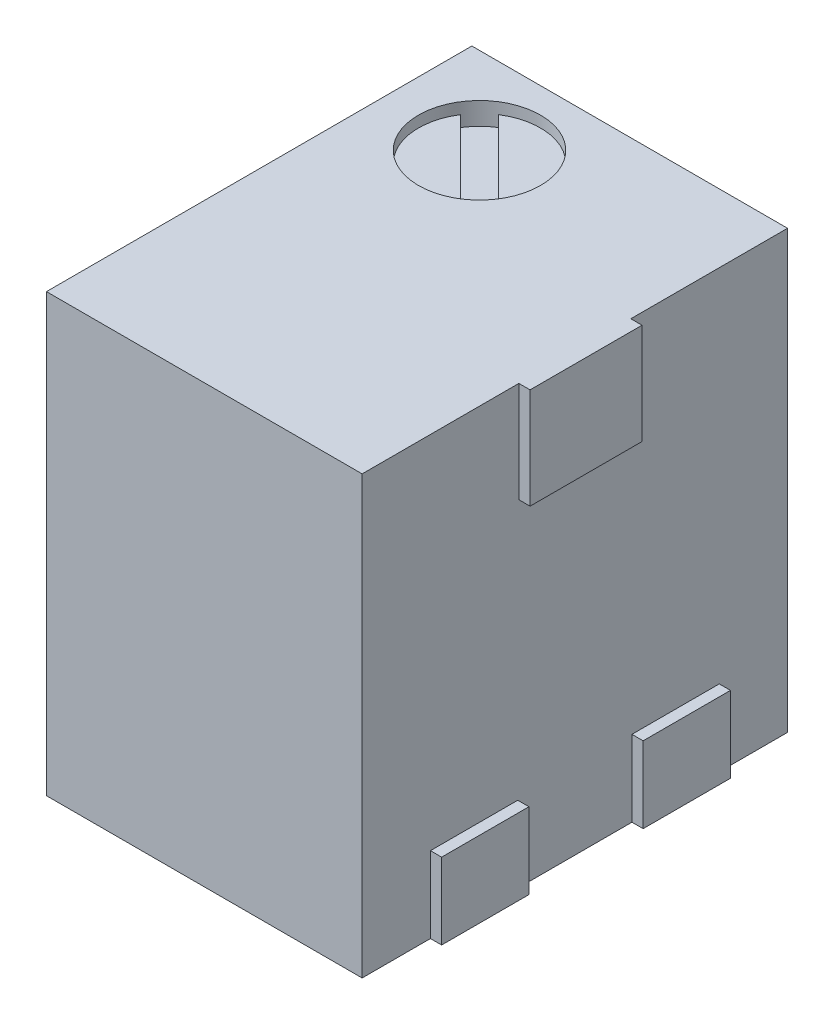
ISO-10303-21;
HEADER;
FILE_DESCRIPTION(('STEP AP214'),'2;1');
FILE_NAME('part.step','',(''),(''),'','','');
FILE_SCHEMA(('AUTOMOTIVE_DESIGN { 1 0 10303 214 1 1 1 1 }'));
ENDSEC;
DATA;
#1=APPLICATION_CONTEXT('core data for automotive mechanical design processes');
#2=APPLICATION_PROTOCOL_DEFINITION('international standard','automotive_design',2000,#1);
#3=PRODUCT_CONTEXT('',#1,'mechanical');
#4=PRODUCT('Part','Part','',(#3));
#5=PRODUCT_RELATED_PRODUCT_CATEGORY('part','',(#4));
#6=PRODUCT_DEFINITION_FORMATION('','',#4);
#7=PRODUCT_DEFINITION_CONTEXT('part definition',#1,'design');
#8=PRODUCT_DEFINITION('design','',#6,#7);
#9=PRODUCT_DEFINITION_SHAPE('','',#8);
#10=(LENGTH_UNIT() NAMED_UNIT(*) SI_UNIT(.MILLI.,.METRE.));
#11=(NAMED_UNIT(*) PLANE_ANGLE_UNIT() SI_UNIT($,.RADIAN.));
#12=(NAMED_UNIT(*) SI_UNIT($,.STERADIAN.) SOLID_ANGLE_UNIT());
#13=UNCERTAINTY_MEASURE_WITH_UNIT(LENGTH_MEASURE(1.E-05),#10,'distance_accuracy_value','');
#14=(GEOMETRIC_REPRESENTATION_CONTEXT(3) GLOBAL_UNCERTAINTY_ASSIGNED_CONTEXT((#13)) GLOBAL_UNIT_ASSIGNED_CONTEXT((#10,
#11,#12)) REPRESENTATION_CONTEXT('',''));
#15=CARTESIAN_POINT('',(0.,0.,0.));
#16=DIRECTION('',(0.,0.,1.));
#17=DIRECTION('',(1.,0.,0.));
#18=AXIS2_PLACEMENT_3D('',#15,#16,#17);
#19=CARTESIAN_POINT('',(-24.148398,1.41349999999973,111.847008));
#20=DIRECTION('',(-1.,0.,0.));
#21=DIRECTION('',(0.,0.,1.));
#22=AXIS2_PLACEMENT_3D('',#19,#20,#21);
#23=PLANE('',#22);
#24=DIRECTION('',(0.,0.,1.));
#25=VECTOR('',#24,1.);
#26=CARTESIAN_POINT('',(-24.148398,-1.06300000000027,111.847008));
#27=LINE('',#26,#25);
#28=CARTESIAN_POINT('',(-24.148398,-1.06300000000027,109.434008));
#29=VERTEX_POINT('',#28);
#30=CARTESIAN_POINT('',(-24.148398,-1.06300000000027,114.260008));
#31=VERTEX_POINT('',#30);
#32=EDGE_CURVE('E11',#29,#31,#27,.T.);
#33=ORIENTED_EDGE('',*,*,#32,.T.);
#34=DIRECTION('',(0.,1.,0.));
#35=VECTOR('',#34,1.);
#36=CARTESIAN_POINT('',(-24.148398,1.41349999999973,114.260008));
#37=LINE('',#36,#35);
#38=CARTESIAN_POINT('',(-24.148398,3.88999999999973,114.260008));
#39=VERTEX_POINT('',#38);
#40=EDGE_CURVE('E27',#31,#39,#37,.T.);
#41=ORIENTED_EDGE('',*,*,#40,.T.);
#42=DIRECTION('',(0.,0.,-1.));
#43=VECTOR('',#42,1.);
#44=CARTESIAN_POINT('',(-24.148398,3.88999999999973,111.847008));
#45=LINE('',#44,#43);
#46=CARTESIAN_POINT('',(-24.148398,3.88999999999973,109.434008));
#47=VERTEX_POINT('',#46);
#48=EDGE_CURVE('E195',#39,#47,#45,.T.);
#49=ORIENTED_EDGE('',*,*,#48,.T.);
#50=DIRECTION('',(0.,-1.,0.));
#51=VECTOR('',#50,1.);
#52=CARTESIAN_POINT('',(-24.148398,1.41349999999973,109.434008));
#53=LINE('',#52,#51);
#54=EDGE_CURVE('E220',#47,#29,#53,.T.);
#55=ORIENTED_EDGE('',*,*,#54,.T.);
#56=EDGE_LOOP('',(#33,#41,#49,#55));
#57=FACE_BOUND('',#56,.T.);
#58=ADVANCED_FACE('F17',(#57),#23,.T.);
#59=CARTESIAN_POINT('',(-20.4399979999999,3.88999999999973,114.260008));
#60=DIRECTION('',(0.,0.,1.));
#61=DIRECTION('',(0.,-1.,0.));
#62=AXIS2_PLACEMENT_3D('',#59,#60,#61);
#63=PLANE('',#62);
#64=DIRECTION('',(0.,1.,0.));
#65=VECTOR('',#64,1.);
#66=CARTESIAN_POINT('',(-20.5669979999999,3.88999999999973,114.260008));
#67=LINE('',#66,#65);
#68=CARTESIAN_POINT('',(-20.5669979999999,-1.06300000000027,114.260008));
#69=VERTEX_POINT('',#68);
#70=CARTESIAN_POINT('',(-20.5669979999999,3.88999999999973,114.260008));
#71=VERTEX_POINT('',#70);
#72=EDGE_CURVE('E217',#69,#71,#67,.T.);
#73=ORIENTED_EDGE('',*,*,#72,.T.);
#74=DIRECTION('',(-1.,0.,0.));
#75=VECTOR('',#74,1.);
#76=CARTESIAN_POINT('',(-20.4399979999999,3.88999999999973,114.260008));
#77=LINE('',#76,#75);
#78=EDGE_CURVE('E215',#71,#39,#77,.T.);
#79=ORIENTED_EDGE('',*,*,#78,.T.);
#80=ORIENTED_EDGE('',*,*,#40,.F.);
#81=DIRECTION('',(1.,0.,0.));
#82=VECTOR('',#81,1.);
#83=CARTESIAN_POINT('',(-20.4399979999999,-1.06300000000027,114.260008));
#84=LINE('',#83,#82);
#85=EDGE_CURVE('E36',#31,#69,#84,.T.);
#86=ORIENTED_EDGE('',*,*,#85,.T.);
#87=EDGE_LOOP('',(#73,#79,#80,#86));
#88=FACE_BOUND('',#87,.T.);
#89=ADVANCED_FACE('F341',(#88),#63,.T.);
#90=CARTESIAN_POINT('',(-20.4399979999999,-1.06300000000027,114.260008));
#91=DIRECTION('',(0.,-1.,0.));
#92=DIRECTION('',(0.,0.,-1.));
#93=AXIS2_PLACEMENT_3D('',#90,#91,#92);
#94=PLANE('',#93);
#95=DIRECTION('',(0.,0.,1.));
#96=VECTOR('',#95,1.);
#97=CARTESIAN_POINT('',(-20.5669979999999,-1.06300000000027,114.260008));
#98=LINE('',#97,#96);
#99=CARTESIAN_POINT('',(-20.5669979999999,-1.06300000000027,113.485308));
#100=VERTEX_POINT('',#99);
#101=EDGE_CURVE('E221',#100,#69,#98,.T.);
#102=ORIENTED_EDGE('',*,*,#101,.T.);
#103=ORIENTED_EDGE('',*,*,#85,.F.);
#104=ORIENTED_EDGE('',*,*,#32,.F.);
#105=DIRECTION('',(1.,0.,0.));
#106=VECTOR('',#105,1.);
#107=CARTESIAN_POINT('',(-20.4399979999999,-1.06300000000027,109.434008));
#108=LINE('',#107,#106);
#109=CARTESIAN_POINT('',(-20.5669979999999,-1.06300000000027,109.434008));
#110=VERTEX_POINT('',#109);
#111=EDGE_CURVE('E183',#29,#110,#108,.T.);
#112=ORIENTED_EDGE('',*,*,#111,.T.);
#113=DIRECTION('',(0.,0.,1.));
#114=VECTOR('',#113,1.);
#115=CARTESIAN_POINT('',(-20.5669979999999,-1.06300000000027,114.260008));
#116=LINE('',#115,#114);
#117=CARTESIAN_POINT('',(-20.5669979999999,-1.06300000000027,110.208708));
#118=VERTEX_POINT('',#117);
#119=EDGE_CURVE('E167',#110,#118,#116,.T.);
#120=ORIENTED_EDGE('',*,*,#119,.T.);
#121=DIRECTION('',(1.,0.,0.));
#122=VECTOR('',#121,1.);
#123=CARTESIAN_POINT('',(-20.4399979999999,-1.06300000000027,110.208708));
#124=LINE('',#123,#122);
#125=CARTESIAN_POINT('',(-20.4399979999999,-1.06300000000027,110.208708));
#126=VERTEX_POINT('',#125);
#127=EDGE_CURVE('E164',#118,#126,#124,.T.);
#128=ORIENTED_EDGE('',*,*,#127,.T.);
#129=DIRECTION('',(0.,0.,1.));
#130=VECTOR('',#129,1.);
#131=CARTESIAN_POINT('',(-20.4399979999999,-1.06300000000027,114.260008));
#132=LINE('',#131,#130);
#133=CARTESIAN_POINT('',(-20.4399979999999,-1.06300000000027,111.199308));
#134=VERTEX_POINT('',#133);
#135=EDGE_CURVE('E168',#126,#134,#132,.T.);
#136=ORIENTED_EDGE('',*,*,#135,.T.);
#137=DIRECTION('',(-1.,0.,0.));
#138=VECTOR('',#137,1.);
#139=CARTESIAN_POINT('',(-20.4399979999999,-1.06300000000027,111.199308));
#140=LINE('',#139,#138);
#141=CARTESIAN_POINT('',(-20.5669979999999,-1.06300000000027,111.199308));
#142=VERTEX_POINT('',#141);
#143=EDGE_CURVE('E157',#134,#142,#140,.T.);
#144=ORIENTED_EDGE('',*,*,#143,.T.);
#145=DIRECTION('',(0.,0.,1.));
#146=VECTOR('',#145,1.);
#147=CARTESIAN_POINT('',(-20.5669979999999,-1.06300000000027,114.260008));
#148=LINE('',#147,#146);
#149=CARTESIAN_POINT('',(-20.5669979999999,-1.06300000000027,112.494708));
#150=VERTEX_POINT('',#149);
#151=EDGE_CURVE('E224',#142,#150,#148,.T.);
#152=ORIENTED_EDGE('',*,*,#151,.T.);
#153=DIRECTION('',(1.,0.,0.));
#154=VECTOR('',#153,1.);
#155=CARTESIAN_POINT('',(-20.4399979999999,-1.06300000000027,112.494708));
#156=LINE('',#155,#154);
#157=CARTESIAN_POINT('',(-20.4399979999999,-1.06300000000027,112.494708));
#158=VERTEX_POINT('',#157);
#159=EDGE_CURVE('E227',#150,#158,#156,.T.);
#160=ORIENTED_EDGE('',*,*,#159,.T.);
#161=DIRECTION('',(0.,0.,1.));
#162=VECTOR('',#161,1.);
#163=CARTESIAN_POINT('',(-20.4399979999999,-1.06300000000027,114.260008));
#164=LINE('',#163,#162);
#165=CARTESIAN_POINT('',(-20.4399979999999,-1.06300000000027,113.485308));
#166=VERTEX_POINT('',#165);
#167=EDGE_CURVE('E289',#158,#166,#164,.T.);
#168=ORIENTED_EDGE('',*,*,#167,.T.);
#169=DIRECTION('',(-1.,0.,0.));
#170=VECTOR('',#169,1.);
#171=CARTESIAN_POINT('',(-20.4399979999999,-1.06300000000027,113.485308));
#172=LINE('',#171,#170);
#173=EDGE_CURVE('E233',#166,#100,#172,.T.);
#174=ORIENTED_EDGE('',*,*,#173,.T.);
#175=EDGE_LOOP('',(#102,#103,#104,#112,#120,#128,#136,#144,#152,#160,#168,#174));
#176=FACE_BOUND('',#175,.T.);
#177=ADVANCED_FACE('F287',(#176),#94,.T.);
#178=CARTESIAN_POINT('',(-20.4399979999999,-1.06300000000027,109.434008));
#179=DIRECTION('',(0.,0.,-1.));
#180=DIRECTION('',(-1.,0.,0.));
#181=AXIS2_PLACEMENT_3D('',#178,#179,#180);
#182=PLANE('',#181);
#183=DIRECTION('',(0.,-1.,0.));
#184=VECTOR('',#183,1.);
#185=CARTESIAN_POINT('',(-20.5669979999999,-1.06300000000027,109.434008));
#186=LINE('',#185,#184);
#187=CARTESIAN_POINT('',(-20.5669979999999,3.88999999999973,109.434008));
#188=VERTEX_POINT('',#187);
#189=EDGE_CURVE('E230',#188,#110,#186,.T.);
#190=ORIENTED_EDGE('',*,*,#189,.T.);
#191=ORIENTED_EDGE('',*,*,#111,.F.);
#192=ORIENTED_EDGE('',*,*,#54,.F.);
#193=DIRECTION('',(1.,0.,0.));
#194=VECTOR('',#193,1.);
#195=CARTESIAN_POINT('',(-20.4399979999999,3.88999999999973,109.434008));
#196=LINE('',#195,#194);
#197=EDGE_CURVE('E207',#47,#188,#196,.T.);
#198=ORIENTED_EDGE('',*,*,#197,.T.);
#199=EDGE_LOOP('',(#190,#191,#192,#198));
#200=FACE_BOUND('',#199,.T.);
#201=ADVANCED_FACE('F321',(#200),#182,.T.);
#202=CARTESIAN_POINT('',(-20.4399979999999,3.88999999999973,109.434008));
#203=DIRECTION('',(0.,1.,0.));
#204=DIRECTION('',(0.,0.,1.));
#205=AXIS2_PLACEMENT_3D('',#202,#203,#204);
#206=PLANE('',#205);
#207=CARTESIAN_POINT('',(-23.0803989278951,3.88999999999973,110.415256828183));
#208=DIRECTION('',(0.,-1.,0.));
#209=DIRECTION('',(1.,0.,0.));
#210=AXIS2_PLACEMENT_3D('',#207,#208,#209);
#211=CIRCLE('',#210,0.692158872138563);
#212=CARTESIAN_POINT('',(-22.3882400557565,3.88999999999973,110.415256828183));
#213=VERTEX_POINT('',#212);
#214=EDGE_CURVE('E204',#213,#213,#211,.T.);
#215=ORIENTED_EDGE('',*,*,#214,.T.);
#216=EDGE_LOOP('',(#215));
#217=FACE_BOUND('',#216,.T.);
#218=DIRECTION('',(0.,0.,-1.));
#219=VECTOR('',#218,1.);
#220=CARTESIAN_POINT('',(-20.5669979999999,3.88999999999973,109.434008));
#221=LINE('',#220,#219);
#222=CARTESIAN_POINT('',(-20.5669979999999,3.88999999999973,112.482008));
#223=VERTEX_POINT('',#222);
#224=EDGE_CURVE('E208',#71,#223,#221,.T.);
#225=ORIENTED_EDGE('',*,*,#224,.T.);
#226=DIRECTION('',(1.,0.,0.));
#227=VECTOR('',#226,1.);
#228=CARTESIAN_POINT('',(-20.4399979999999,3.88999999999973,112.482008));
#229=LINE('',#228,#227);
#230=CARTESIAN_POINT('',(-20.4399979999999,3.88999999999973,112.482008));
#231=VERTEX_POINT('',#230);
#232=EDGE_CURVE('E200',#223,#231,#229,.T.);
#233=ORIENTED_EDGE('',*,*,#232,.T.);
#234=DIRECTION('',(0.,0.,-1.));
#235=VECTOR('',#234,1.);
#236=CARTESIAN_POINT('',(-20.4399979999999,3.88999999999973,109.434008));
#237=LINE('',#236,#235);
#238=CARTESIAN_POINT('',(-20.4399979999999,3.88999999999973,111.212008));
#239=VERTEX_POINT('',#238);
#240=EDGE_CURVE('E197',#231,#239,#237,.T.);
#241=ORIENTED_EDGE('',*,*,#240,.T.);
#242=DIRECTION('',(-1.,0.,0.));
#243=VECTOR('',#242,1.);
#244=CARTESIAN_POINT('',(-20.4399979999999,3.88999999999973,111.212008));
#245=LINE('',#244,#243);
#246=CARTESIAN_POINT('',(-20.5669979999999,3.88999999999973,111.212008));
#247=VERTEX_POINT('',#246);
#248=EDGE_CURVE('E201',#239,#247,#245,.T.);
#249=ORIENTED_EDGE('',*,*,#248,.T.);
#250=DIRECTION('',(0.,0.,-1.));
#251=VECTOR('',#250,1.);
#252=CARTESIAN_POINT('',(-20.5669979999999,3.88999999999973,109.434008));
#253=LINE('',#252,#251);
#254=EDGE_CURVE('E271',#247,#188,#253,.T.);
#255=ORIENTED_EDGE('',*,*,#254,.T.);
#256=ORIENTED_EDGE('',*,*,#197,.F.);
#257=ORIENTED_EDGE('',*,*,#48,.F.);
#258=ORIENTED_EDGE('',*,*,#78,.F.);
#259=EDGE_LOOP('',(#225,#233,#241,#249,#255,#256,#257,#258));
#260=FACE_BOUND('',#259,.T.);
#261=ADVANCED_FACE('F343',(#217,#260),#206,.T.);
#262=CARTESIAN_POINT('',(-20.5669979999999,1.18091898454719,111.847008));
#263=DIRECTION('',(1.,0.,0.));
#264=DIRECTION('',(0.,0.,-1.));
#265=AXIS2_PLACEMENT_3D('',#262,#263,#264);
#266=PLANE('',#265);
#267=ORIENTED_EDGE('',*,*,#189,.F.);
#268=ORIENTED_EDGE('',*,*,#254,.F.);
#269=DIRECTION('',(0.,-1.,0.));
#270=VECTOR('',#269,1.);
#271=CARTESIAN_POINT('',(-20.5669979999999,1.18091898454719,111.212008));
#272=LINE('',#271,#270);
#273=CARTESIAN_POINT('',(-20.5669979999999,2.74699999999973,111.212008));
#274=VERTEX_POINT('',#273);
#275=EDGE_CURVE('E268',#247,#274,#272,.T.);
#276=ORIENTED_EDGE('',*,*,#275,.T.);
#277=DIRECTION('',(0.,0.,1.));
#278=VECTOR('',#277,1.);
#279=CARTESIAN_POINT('',(-20.5669979999999,2.74699999999973,111.847008));
#280=LINE('',#279,#278);
#281=CARTESIAN_POINT('',(-20.5669979999999,2.74699999999973,112.482008));
#282=VERTEX_POINT('',#281);
#283=EDGE_CURVE('E162',#274,#282,#280,.T.);
#284=ORIENTED_EDGE('',*,*,#283,.T.);
#285=DIRECTION('',(0.,1.,0.));
#286=VECTOR('',#285,1.);
#287=CARTESIAN_POINT('',(-20.5669979999999,1.18091898454719,112.482008));
#288=LINE('',#287,#286);
#289=EDGE_CURVE('E159',#282,#223,#288,.T.);
#290=ORIENTED_EDGE('',*,*,#289,.T.);
#291=ORIENTED_EDGE('',*,*,#224,.F.);
#292=ORIENTED_EDGE('',*,*,#72,.F.);
#293=ORIENTED_EDGE('',*,*,#101,.F.);
#294=DIRECTION('',(0.,1.,0.));
#295=VECTOR('',#294,1.);
#296=CARTESIAN_POINT('',(-20.5669979999999,1.18091898454719,113.485308));
#297=LINE('',#296,#295);
#298=CARTESIAN_POINT('',(-20.5669979999999,-0.199400000000271,113.485308));
#299=VERTEX_POINT('',#298);
#300=EDGE_CURVE('E163',#100,#299,#297,.T.);
#301=ORIENTED_EDGE('',*,*,#300,.T.);
#302=DIRECTION('',(0.,0.,-1.));
#303=VECTOR('',#302,1.);
#304=CARTESIAN_POINT('',(-20.5669979999999,-0.199400000000271,111.847008));
#305=LINE('',#304,#303);
#306=CARTESIAN_POINT('',(-20.5669979999999,-0.199400000000271,112.494708));
#307=VERTEX_POINT('',#306);
#308=EDGE_CURVE('E237',#299,#307,#305,.T.);
#309=ORIENTED_EDGE('',*,*,#308,.T.);
#310=DIRECTION('',(0.,-1.,0.));
#311=VECTOR('',#310,1.);
#312=CARTESIAN_POINT('',(-20.5669979999999,1.18091898454719,112.494708));
#313=LINE('',#312,#311);
#314=EDGE_CURVE('E234',#307,#150,#313,.T.);
#315=ORIENTED_EDGE('',*,*,#314,.T.);
#316=ORIENTED_EDGE('',*,*,#151,.F.);
#317=DIRECTION('',(0.,1.,0.));
#318=VECTOR('',#317,1.);
#319=CARTESIAN_POINT('',(-20.5669979999999,1.18091898454719,111.199308));
#320=LINE('',#319,#318);
#321=CARTESIAN_POINT('',(-20.5669979999999,-0.199400000000271,111.199308));
#322=VERTEX_POINT('',#321);
#323=EDGE_CURVE('E21',#142,#322,#320,.T.);
#324=ORIENTED_EDGE('',*,*,#323,.T.);
#325=DIRECTION('',(0.,0.,-1.));
#326=VECTOR('',#325,1.);
#327=CARTESIAN_POINT('',(-20.5669979999999,-0.199400000000271,111.847008));
#328=LINE('',#327,#326);
#329=CARTESIAN_POINT('',(-20.5669979999999,-0.199400000000271,110.208708));
#330=VERTEX_POINT('',#329);
#331=EDGE_CURVE('E187',#322,#330,#328,.T.);
#332=ORIENTED_EDGE('',*,*,#331,.T.);
#333=DIRECTION('',(0.,-1.,0.));
#334=VECTOR('',#333,1.);
#335=CARTESIAN_POINT('',(-20.5669979999999,1.18091898454719,110.208708));
#336=LINE('',#335,#334);
#337=EDGE_CURVE('E184',#330,#118,#336,.T.);
#338=ORIENTED_EDGE('',*,*,#337,.T.);
#339=ORIENTED_EDGE('',*,*,#119,.F.);
#340=EDGE_LOOP('',(#267,#268,#276,#284,#290,#291,#292,#293,#301,#309,#315,#316,#324,#332,#338,#339));
#341=FACE_BOUND('',#340,.T.);
#342=ADVANCED_FACE('F277',(#341),#266,.T.);
#343=CARTESIAN_POINT('',(-20.4399979999999,-1.06300000000027,113.485308));
#344=DIRECTION('',(0.,0.,1.));
#345=DIRECTION('',(0.,-1.,0.));
#346=AXIS2_PLACEMENT_3D('',#343,#344,#345);
#347=PLANE('',#346);
#348=ORIENTED_EDGE('',*,*,#300,.F.);
#349=ORIENTED_EDGE('',*,*,#173,.F.);
#350=DIRECTION('',(0.,1.,0.));
#351=VECTOR('',#350,1.);
#352=CARTESIAN_POINT('',(-20.4399979999999,-1.06300000000027,113.485308));
#353=LINE('',#352,#351);
#354=CARTESIAN_POINT('',(-20.4399979999999,-0.199400000000271,113.485308));
#355=VERTEX_POINT('',#354);
#356=EDGE_CURVE('E188',#166,#355,#353,.T.);
#357=ORIENTED_EDGE('',*,*,#356,.T.);
#358=DIRECTION('',(-1.,0.,0.));
#359=VECTOR('',#358,1.);
#360=CARTESIAN_POINT('',(-20.4399979999999,-0.199400000000271,113.485308));
#361=LINE('',#360,#359);
#362=EDGE_CURVE('E241',#355,#299,#361,.T.);
#363=ORIENTED_EDGE('',*,*,#362,.T.);
#364=EDGE_LOOP('',(#348,#349,#357,#363));
#365=FACE_BOUND('',#364,.T.);
#366=ADVANCED_FACE('F283',(#365),#347,.T.);
#367=CARTESIAN_POINT('',(-20.4399979999999,1.41349999999973,111.847008));
#368=DIRECTION('',(1.,0.,0.));
#369=DIRECTION('',(0.,0.,-1.));
#370=AXIS2_PLACEMENT_3D('',#367,#368,#369);
#371=PLANE('',#370);
#372=DIRECTION('',(0.,1.,0.));
#373=VECTOR('',#372,1.);
#374=CARTESIAN_POINT('',(-20.4399979999999,1.41349999999973,112.494708));
#375=LINE('',#374,#373);
#376=CARTESIAN_POINT('',(-20.4399979999999,-0.199400000000271,112.494708));
#377=VERTEX_POINT('',#376);
#378=EDGE_CURVE('E239',#158,#377,#375,.T.);
#379=ORIENTED_EDGE('',*,*,#378,.T.);
#380=DIRECTION('',(0.,0.,1.));
#381=VECTOR('',#380,1.);
#382=CARTESIAN_POINT('',(-20.4399979999999,-0.199400000000271,111.847008));
#383=LINE('',#382,#381);
#384=EDGE_CURVE('E242',#377,#355,#383,.T.);
#385=ORIENTED_EDGE('',*,*,#384,.T.);
#386=ORIENTED_EDGE('',*,*,#356,.F.);
#387=ORIENTED_EDGE('',*,*,#167,.F.);
#388=EDGE_LOOP('',(#379,#385,#386,#387));
#389=FACE_BOUND('',#388,.T.);
#390=ADVANCED_FACE('F391',(#389),#371,.T.);
#391=CARTESIAN_POINT('',(-20.4399979999999,-0.199400000000271,112.494708));
#392=DIRECTION('',(0.,0.,-1.));
#393=DIRECTION('',(-1.,0.,0.));
#394=AXIS2_PLACEMENT_3D('',#391,#392,#393);
#395=PLANE('',#394);
#396=ORIENTED_EDGE('',*,*,#314,.F.);
#397=DIRECTION('',(1.,0.,0.));
#398=VECTOR('',#397,1.);
#399=CARTESIAN_POINT('',(-20.4399979999999,-0.199400000000271,112.494708));
#400=LINE('',#399,#398);
#401=EDGE_CURVE('E248',#307,#377,#400,.T.);
#402=ORIENTED_EDGE('',*,*,#401,.T.);
#403=ORIENTED_EDGE('',*,*,#378,.F.);
#404=ORIENTED_EDGE('',*,*,#159,.F.);
#405=EDGE_LOOP('',(#396,#402,#403,#404));
#406=FACE_BOUND('',#405,.T.);
#407=ADVANCED_FACE('F394',(#406),#395,.T.);
#408=CARTESIAN_POINT('',(-20.4399979999999,-1.06300000000027,111.199308));
#409=DIRECTION('',(0.,0.,1.));
#410=DIRECTION('',(0.,-1.,0.));
#411=AXIS2_PLACEMENT_3D('',#408,#409,#410);
#412=PLANE('',#411);
#413=ORIENTED_EDGE('',*,*,#323,.F.);
#414=ORIENTED_EDGE('',*,*,#143,.F.);
#415=DIRECTION('',(0.,1.,0.));
#416=VECTOR('',#415,1.);
#417=CARTESIAN_POINT('',(-20.4399979999999,-1.06300000000027,111.199308));
#418=LINE('',#417,#416);
#419=CARTESIAN_POINT('',(-20.4399979999999,-0.199400000000271,111.199308));
#420=VERTEX_POINT('',#419);
#421=EDGE_CURVE('E253',#134,#420,#418,.T.);
#422=ORIENTED_EDGE('',*,*,#421,.T.);
#423=DIRECTION('',(-1.,0.,0.));
#424=VECTOR('',#423,1.);
#425=CARTESIAN_POINT('',(-20.4399979999999,-0.199400000000271,111.199308));
#426=LINE('',#425,#424);
#427=EDGE_CURVE('E257',#420,#322,#426,.T.);
#428=ORIENTED_EDGE('',*,*,#427,.T.);
#429=EDGE_LOOP('',(#413,#414,#422,#428));
#430=FACE_BOUND('',#429,.T.);
#431=ADVANCED_FACE('F397',(#430),#412,.T.);
#432=CARTESIAN_POINT('',(-20.4399979999999,1.41349999999973,111.847008));
#433=DIRECTION('',(1.,0.,0.));
#434=DIRECTION('',(0.,0.,-1.));
#435=AXIS2_PLACEMENT_3D('',#432,#433,#434);
#436=PLANE('',#435);
#437=DIRECTION('',(0.,1.,0.));
#438=VECTOR('',#437,1.);
#439=CARTESIAN_POINT('',(-20.4399979999999,1.41349999999973,110.208708));
#440=LINE('',#439,#438);
#441=CARTESIAN_POINT('',(-20.4399979999999,-0.199400000000271,110.208708));
#442=VERTEX_POINT('',#441);
#443=EDGE_CURVE('E192',#126,#442,#440,.T.);
#444=ORIENTED_EDGE('',*,*,#443,.T.);
#445=DIRECTION('',(0.,0.,1.));
#446=VECTOR('',#445,1.);
#447=CARTESIAN_POINT('',(-20.4399979999999,-0.199400000000271,111.847008));
#448=LINE('',#447,#446);
#449=EDGE_CURVE('E189',#442,#420,#448,.T.);
#450=ORIENTED_EDGE('',*,*,#449,.T.);
#451=ORIENTED_EDGE('',*,*,#421,.F.);
#452=ORIENTED_EDGE('',*,*,#135,.F.);
#453=EDGE_LOOP('',(#444,#450,#451,#452));
#454=FACE_BOUND('',#453,.T.);
#455=ADVANCED_FACE('F401',(#454),#436,.T.);
#456=CARTESIAN_POINT('',(-20.4399979999999,-0.199400000000271,110.208708));
#457=DIRECTION('',(0.,0.,-1.));
#458=DIRECTION('',(-1.,0.,0.));
#459=AXIS2_PLACEMENT_3D('',#456,#457,#458);
#460=PLANE('',#459);
#461=ORIENTED_EDGE('',*,*,#337,.F.);
#462=DIRECTION('',(1.,0.,0.));
#463=VECTOR('',#462,1.);
#464=CARTESIAN_POINT('',(-20.4399979999999,-0.199400000000271,110.208708));
#465=LINE('',#464,#463);
#466=EDGE_CURVE('E177',#330,#442,#465,.T.);
#467=ORIENTED_EDGE('',*,*,#466,.T.);
#468=ORIENTED_EDGE('',*,*,#443,.F.);
#469=ORIENTED_EDGE('',*,*,#127,.F.);
#470=EDGE_LOOP('',(#461,#467,#468,#469));
#471=FACE_BOUND('',#470,.T.);
#472=ADVANCED_FACE('F405',(#471),#460,.T.);
#473=CARTESIAN_POINT('',(-20.4399979999999,3.88999999999973,112.482008));
#474=DIRECTION('',(0.,0.,1.));
#475=DIRECTION('',(0.,-1.,0.));
#476=AXIS2_PLACEMENT_3D('',#473,#474,#475);
#477=PLANE('',#476);
#478=ORIENTED_EDGE('',*,*,#289,.F.);
#479=DIRECTION('',(1.,0.,0.));
#480=VECTOR('',#479,1.);
#481=CARTESIAN_POINT('',(-20.4399979999999,2.74699999999973,112.482008));
#482=LINE('',#481,#480);
#483=CARTESIAN_POINT('',(-20.4399979999999,2.74699999999973,112.482008));
#484=VERTEX_POINT('',#483);
#485=EDGE_CURVE('E174',#282,#484,#482,.T.);
#486=ORIENTED_EDGE('',*,*,#485,.T.);
#487=DIRECTION('',(0.,1.,0.));
#488=VECTOR('',#487,1.);
#489=CARTESIAN_POINT('',(-20.4399979999999,3.88999999999973,112.482008));
#490=LINE('',#489,#488);
#491=EDGE_CURVE('E172',#484,#231,#490,.T.);
#492=ORIENTED_EDGE('',*,*,#491,.T.);
#493=ORIENTED_EDGE('',*,*,#232,.F.);
#494=EDGE_LOOP('',(#478,#486,#492,#493));
#495=FACE_BOUND('',#494,.T.);
#496=ADVANCED_FACE('F347',(#495),#477,.T.);
#497=CARTESIAN_POINT('',(-20.4399979999999,2.74699999999973,111.212008));
#498=DIRECTION('',(0.,0.,-1.));
#499=DIRECTION('',(-1.,0.,0.));
#500=AXIS2_PLACEMENT_3D('',#497,#498,#499);
#501=PLANE('',#500);
#502=ORIENTED_EDGE('',*,*,#275,.F.);
#503=ORIENTED_EDGE('',*,*,#248,.F.);
#504=DIRECTION('',(0.,-1.,0.));
#505=VECTOR('',#504,1.);
#506=CARTESIAN_POINT('',(-20.4399979999999,2.74699999999973,111.212008));
#507=LINE('',#506,#505);
#508=CARTESIAN_POINT('',(-20.4399979999999,2.74699999999973,111.212008));
#509=VERTEX_POINT('',#508);
#510=EDGE_CURVE('E169',#239,#509,#507,.T.);
#511=ORIENTED_EDGE('',*,*,#510,.T.);
#512=DIRECTION('',(-1.,0.,0.));
#513=VECTOR('',#512,1.);
#514=CARTESIAN_POINT('',(-20.4399979999999,2.74699999999973,111.212008));
#515=LINE('',#514,#513);
#516=EDGE_CURVE('E173',#509,#274,#515,.T.);
#517=ORIENTED_EDGE('',*,*,#516,.T.);
#518=EDGE_LOOP('',(#502,#503,#511,#517));
#519=FACE_BOUND('',#518,.T.);
#520=ADVANCED_FACE('F354',(#519),#501,.T.);
#521=CARTESIAN_POINT('',(-20.4399979999999,1.41349999999973,111.847008));
#522=DIRECTION('',(1.,0.,0.));
#523=DIRECTION('',(0.,0.,-1.));
#524=AXIS2_PLACEMENT_3D('',#521,#522,#523);
#525=PLANE('',#524);
#526=ORIENTED_EDGE('',*,*,#510,.F.);
#527=ORIENTED_EDGE('',*,*,#240,.F.);
#528=ORIENTED_EDGE('',*,*,#491,.F.);
#529=DIRECTION('',(0.,0.,-1.));
#530=VECTOR('',#529,1.);
#531=CARTESIAN_POINT('',(-20.4399979999999,2.74699999999973,111.847008));
#532=LINE('',#531,#530);
#533=EDGE_CURVE('E178',#484,#509,#532,.T.);
#534=ORIENTED_EDGE('',*,*,#533,.T.);
#535=EDGE_LOOP('',(#526,#527,#528,#534));
#536=FACE_BOUND('',#535,.T.);
#537=ADVANCED_FACE('F350',(#536),#525,.T.);
#538=CARTESIAN_POINT('',(-20.4399979999999,-0.199400000000271,111.199308));
#539=DIRECTION('',(0.,1.,0.));
#540=DIRECTION('',(0.,0.,1.));
#541=AXIS2_PLACEMENT_3D('',#538,#539,#540);
#542=PLANE('',#541);
#543=ORIENTED_EDGE('',*,*,#331,.F.);
#544=ORIENTED_EDGE('',*,*,#427,.F.);
#545=ORIENTED_EDGE('',*,*,#449,.F.);
#546=ORIENTED_EDGE('',*,*,#466,.F.);
#547=EDGE_LOOP('',(#543,#544,#545,#546));
#548=FACE_BOUND('',#547,.T.);
#549=ADVANCED_FACE('F370',(#548),#542,.T.);
#550=CARTESIAN_POINT('',(-20.4399979999999,-0.199400000000271,113.485308));
#551=DIRECTION('',(0.,1.,0.));
#552=DIRECTION('',(0.,0.,1.));
#553=AXIS2_PLACEMENT_3D('',#550,#551,#552);
#554=PLANE('',#553);
#555=ORIENTED_EDGE('',*,*,#308,.F.);
#556=ORIENTED_EDGE('',*,*,#362,.F.);
#557=ORIENTED_EDGE('',*,*,#384,.F.);
#558=ORIENTED_EDGE('',*,*,#401,.F.);
#559=EDGE_LOOP('',(#555,#556,#557,#558));
#560=FACE_BOUND('',#559,.T.);
#561=ADVANCED_FACE('F360',(#560),#554,.T.);
#562=CARTESIAN_POINT('',(-20.4399979999999,2.74699999999973,112.482008));
#563=DIRECTION('',(0.,-1.,0.));
#564=DIRECTION('',(0.,0.,-1.));
#565=AXIS2_PLACEMENT_3D('',#562,#563,#564);
#566=PLANE('',#565);
#567=ORIENTED_EDGE('',*,*,#283,.F.);
#568=ORIENTED_EDGE('',*,*,#516,.F.);
#569=ORIENTED_EDGE('',*,*,#533,.F.);
#570=ORIENTED_EDGE('',*,*,#485,.F.);
#571=EDGE_LOOP('',(#567,#568,#569,#570));
#572=FACE_BOUND('',#571,.T.);
#573=ADVANCED_FACE('F357',(#572),#566,.T.);
#574=CARTESIAN_POINT('',(-23.0803989278951,3.76299999999973,110.415256828183));
#575=DIRECTION('',(0.,1.,0.));
#576=DIRECTION('',(0.,0.,1.));
#577=AXIS2_PLACEMENT_3D('',#574,#575,#576);
#578=PLANE('',#577);
#579=DIRECTION('',(-0.705108528470342,0.,-0.70909940281909));
#580=VECTOR('',#579,1.);
#581=CARTESIAN_POINT('',(-22.7123956638741,3.76299999999973,111.001479910251));
#582=LINE('',#581,#580);
#583=CARTESIAN_POINT('',(-22.7123956638741,3.76299999999973,111.001479910251));
#584=VERTEX_POINT('',#583);
#585=CARTESIAN_POINT('',(-23.6645356898953,3.76299999999973,110.043950825592));
#586=VERTEX_POINT('',#585);
#587=EDGE_CURVE('E132',#584,#586,#582,.T.);
#588=ORIENTED_EDGE('',*,*,#587,.T.);
#589=CARTESIAN_POINT('',(-23.0803989278951,3.76299999999973,110.415256828183));
#590=DIRECTION('',(0.,1.,0.));
#591=DIRECTION('',(1.,0.,0.));
#592=AXIS2_PLACEMENT_3D('',#589,#590,#591);
#593=CIRCLE('',#592,0.692158872138563);
#594=EDGE_CURVE('E209',#586,#584,#593,.T.);
#595=ORIENTED_EDGE('',*,*,#594,.T.);
#596=EDGE_LOOP('',(#588,#595));
#597=FACE_BOUND('',#596,.T.);
#598=ADVANCED_FACE('F359',(#597),#578,.T.);
#599=CARTESIAN_POINT('',(-23.0803989278951,3.76299999999973,110.415256828183));
#600=DIRECTION('',(0.,1.,0.));
#601=DIRECTION('',(0.,0.,1.));
#602=AXIS2_PLACEMENT_3D('',#599,#600,#601);
#603=PLANE('',#602);
#604=DIRECTION('',(0.705108528470342,0.,0.70909940281909));
#605=VECTOR('',#604,1.);
#606=CARTESIAN_POINT('',(-23.4484021919161,3.76299999999973,109.829033746114));
#607=LINE('',#606,#605);
#608=CARTESIAN_POINT('',(-23.4484021919161,3.76299999999973,109.829033746114));
#609=VERTEX_POINT('',#608);
#610=CARTESIAN_POINT('',(-22.4962621658949,3.76299999999973,110.786562830774));
#611=VERTEX_POINT('',#610);
#612=EDGE_CURVE('E211',#609,#611,#607,.T.);
#613=ORIENTED_EDGE('',*,*,#612,.T.);
#614=CARTESIAN_POINT('',(-23.0803989278951,3.76299999999973,110.415256828183));
#615=DIRECTION('',(0.,1.,0.));
#616=DIRECTION('',(1.,0.,0.));
#617=AXIS2_PLACEMENT_3D('',#614,#615,#616);
#618=CIRCLE('',#617,0.692158872138563);
#619=EDGE_CURVE('E145',#611,#609,#618,.T.);
#620=ORIENTED_EDGE('',*,*,#619,.T.);
#621=EDGE_LOOP('',(#613,#620));
#622=FACE_BOUND('',#621,.T.);
#623=ADVANCED_FACE('F367',(#622),#603,.T.);
#624=CARTESIAN_POINT('',(-23.6645356898953,3.63599999999973,110.043950825592));
#625=DIRECTION('',(0.70909940281909,0.,-0.705108528470342));
#626=DIRECTION('',(-0.705108528470342,0.,-0.70909940281909));
#627=AXIS2_PLACEMENT_3D('',#624,#625,#626);
#628=PLANE('',#627);
#629=DIRECTION('',(0.,1.,0.));
#630=VECTOR('',#629,1.);
#631=CARTESIAN_POINT('',(-22.7123956638741,3.63599999999973,111.001479910251));
#632=LINE('',#631,#630);
#633=CARTESIAN_POINT('',(-22.7123956638741,3.63599999999973,111.001479910251));
#634=VERTEX_POINT('',#633);
#635=EDGE_CURVE('E124',#634,#584,#632,.T.);
#636=ORIENTED_EDGE('',*,*,#635,.F.);
#637=DIRECTION('',(0.705108528470342,0.,0.70909940281909));
#638=VECTOR('',#637,1.);
#639=CARTESIAN_POINT('',(-23.6645356898953,3.63599999999973,110.043950825592));
#640=LINE('',#639,#638);
#641=CARTESIAN_POINT('',(-23.6645356898953,3.63599999999973,110.043950825592));
#642=VERTEX_POINT('',#641);
#643=EDGE_CURVE('E129',#642,#634,#640,.T.);
#644=ORIENTED_EDGE('',*,*,#643,.F.);
#645=DIRECTION('',(0.,-1.,0.));
#646=VECTOR('',#645,1.);
#647=CARTESIAN_POINT('',(-23.6645356898953,3.63599999999973,110.043950825592));
#648=LINE('',#647,#646);
#649=EDGE_CURVE('E137',#586,#642,#648,.T.);
#650=ORIENTED_EDGE('',*,*,#649,.F.);
#651=ORIENTED_EDGE('',*,*,#587,.F.);
#652=EDGE_LOOP('',(#636,#644,#650,#651));
#653=FACE_BOUND('',#652,.T.);
#654=ADVANCED_FACE('F126',(#653),#628,.T.);
#655=CARTESIAN_POINT('',(-23.4484021919161,3.63599999999973,109.829033746114));
#656=DIRECTION('',(-0.70909940281909,0.,0.705108528470342));
#657=DIRECTION('',(0.705108528470342,0.,0.70909940281909));
#658=AXIS2_PLACEMENT_3D('',#655,#656,#657);
#659=PLANE('',#658);
#660=DIRECTION('',(0.,1.,0.));
#661=VECTOR('',#660,1.);
#662=CARTESIAN_POINT('',(-23.4484021919161,3.63599999999973,109.829033746114));
#663=LINE('',#662,#661);
#664=CARTESIAN_POINT('',(-23.4484021919161,3.63599999999973,109.829033746114));
#665=VERTEX_POINT('',#664);
#666=EDGE_CURVE('E212',#665,#609,#663,.T.);
#667=ORIENTED_EDGE('',*,*,#666,.F.);
#668=DIRECTION('',(-0.705108528470342,0.,-0.70909940281909));
#669=VECTOR('',#668,1.);
#670=CARTESIAN_POINT('',(-23.4484021919161,3.63599999999973,109.829033746114));
#671=LINE('',#670,#669);
#672=CARTESIAN_POINT('',(-22.4962621658949,3.63599999999973,110.786562830774));
#673=VERTEX_POINT('',#672);
#674=EDGE_CURVE('E146',#673,#665,#671,.T.);
#675=ORIENTED_EDGE('',*,*,#674,.F.);
#676=DIRECTION('',(0.,-1.,0.));
#677=VECTOR('',#676,1.);
#678=CARTESIAN_POINT('',(-22.4962621658949,3.63599999999973,110.786562830774));
#679=LINE('',#678,#677);
#680=EDGE_CURVE('E136',#611,#673,#679,.T.);
#681=ORIENTED_EDGE('',*,*,#680,.F.);
#682=ORIENTED_EDGE('',*,*,#612,.F.);
#683=EDGE_LOOP('',(#667,#675,#681,#682));
#684=FACE_BOUND('',#683,.T.);
#685=ADVANCED_FACE('F467',(#684),#659,.T.);
#686=CARTESIAN_POINT('',(-23.0803989278951,3.63599999999973,110.415256828183));
#687=DIRECTION('',(0.,1.,0.));
#688=DIRECTION('',(0.,0.,1.));
#689=AXIS2_PLACEMENT_3D('',#686,#687,#688);
#690=PLANE('',#689);
#691=CARTESIAN_POINT('',(-23.0803989278951,3.63599999999973,110.415256828183));
#692=DIRECTION('',(0.,1.,0.));
#693=DIRECTION('',(1.,0.,0.));
#694=AXIS2_PLACEMENT_3D('',#691,#692,#693);
#695=CIRCLE('',#694,0.692158872138563);
#696=EDGE_CURVE('E141',#634,#673,#695,.T.);
#697=ORIENTED_EDGE('',*,*,#696,.T.);
#698=ORIENTED_EDGE('',*,*,#674,.T.);
#699=CARTESIAN_POINT('',(-23.0803989278951,3.63599999999973,110.415256828183));
#700=DIRECTION('',(0.,1.,0.));
#701=DIRECTION('',(1.,0.,0.));
#702=AXIS2_PLACEMENT_3D('',#699,#700,#701);
#703=CIRCLE('',#702,0.692158872138563);
#704=EDGE_CURVE('E150',#665,#642,#703,.T.);
#705=ORIENTED_EDGE('',*,*,#704,.T.);
#706=ORIENTED_EDGE('',*,*,#643,.T.);
#707=EDGE_LOOP('',(#697,#698,#705,#706));
#708=FACE_BOUND('',#707,.T.);
#709=ADVANCED_FACE('F148',(#708),#690,.T.);
#710=CARTESIAN_POINT('',(-23.0803989278951,3.76299999999973,110.415256828183));
#711=DIRECTION('',(0.,-1.,0.));
#712=DIRECTION('',(0.,0.,-1.));
#713=AXIS2_PLACEMENT_3D('',#710,#711,#712);
#714=CYLINDRICAL_SURFACE('',#713,0.692158872138563);
#715=ORIENTED_EDGE('',*,*,#214,.F.);
#716=EDGE_LOOP('',(#715));
#717=FACE_BOUND('',#716,.T.);
#718=ORIENTED_EDGE('',*,*,#594,.F.);
#719=ORIENTED_EDGE('',*,*,#649,.T.);
#720=ORIENTED_EDGE('',*,*,#704,.F.);
#721=ORIENTED_EDGE('',*,*,#666,.T.);
#722=ORIENTED_EDGE('',*,*,#619,.F.);
#723=ORIENTED_EDGE('',*,*,#680,.T.);
#724=ORIENTED_EDGE('',*,*,#696,.F.);
#725=ORIENTED_EDGE('',*,*,#635,.T.);
#726=EDGE_LOOP('',(#718,#719,#720,#721,#722,#723,#724,#725));
#727=FACE_BOUND('',#726,.T.);
#728=ADVANCED_FACE('F19',(#717,#727),#714,.F.);
#729=CLOSED_SHELL('',(#58,#89,#177,#201,#261,#342,#366,#390,#407,#431,#455,#472,#496,#520,#537,
#549,#561,#573,#598,#623,#654,#685,#709,#728));
#730=MANIFOLD_SOLID_BREP('B1',#729);
#731=ADVANCED_BREP_SHAPE_REPRESENTATION('',(#18,#730),#14);
#732=SHAPE_DEFINITION_REPRESENTATION(#9,#731);
ENDSEC;
END-ISO-10303-21;
